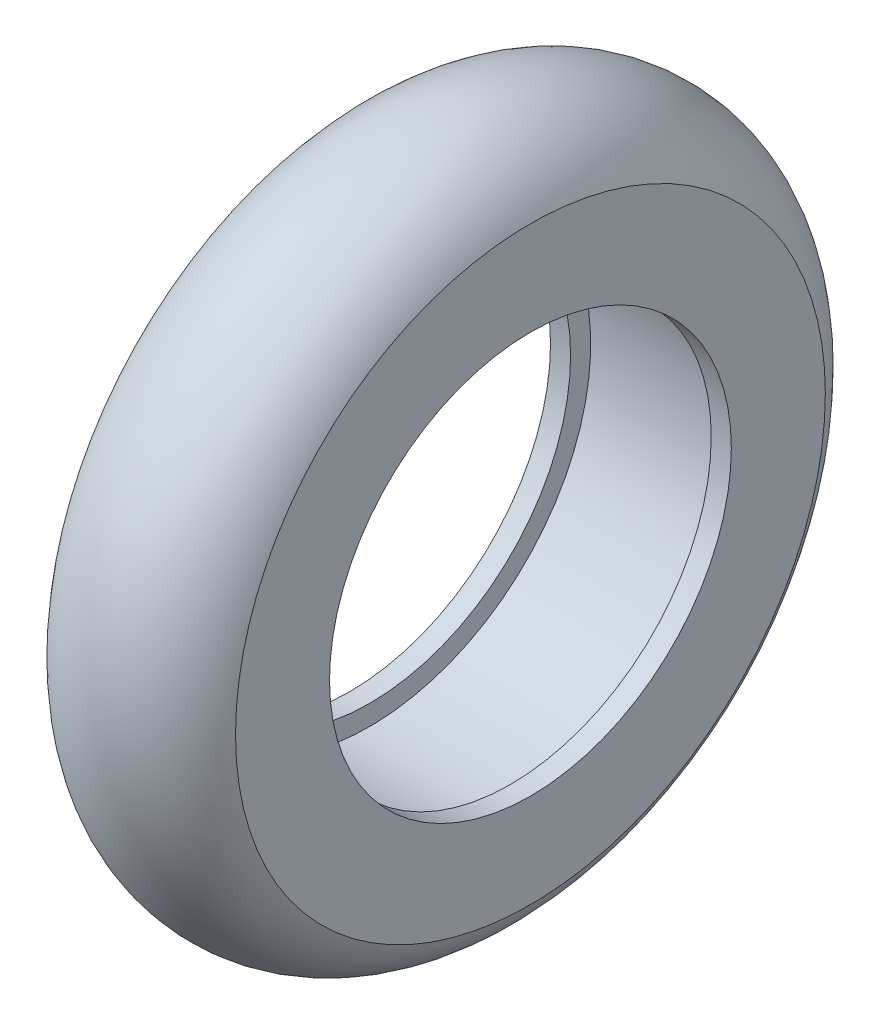
ISO-10303-21;
HEADER;
FILE_DESCRIPTION(('STEP AP214'),'2;1');
FILE_NAME('part.step','',(''),(''),'','','');
FILE_SCHEMA(('AUTOMOTIVE_DESIGN { 1 0 10303 214 1 1 1 1 }'));
ENDSEC;
DATA;
#1=APPLICATION_CONTEXT('core data for automotive mechanical design processes');
#2=APPLICATION_PROTOCOL_DEFINITION('international standard','automotive_design',2000,#1);
#3=PRODUCT_CONTEXT('',#1,'mechanical');
#4=PRODUCT('Part','Part','',(#3));
#5=PRODUCT_RELATED_PRODUCT_CATEGORY('part','',(#4));
#6=PRODUCT_DEFINITION_FORMATION('','',#4);
#7=PRODUCT_DEFINITION_CONTEXT('part definition',#1,'design');
#8=PRODUCT_DEFINITION('design','',#6,#7);
#9=PRODUCT_DEFINITION_SHAPE('','',#8);
#10=(LENGTH_UNIT() NAMED_UNIT(*) SI_UNIT(.MILLI.,.METRE.));
#11=(NAMED_UNIT(*) PLANE_ANGLE_UNIT() SI_UNIT($,.RADIAN.));
#12=(NAMED_UNIT(*) SI_UNIT($,.STERADIAN.) SOLID_ANGLE_UNIT());
#13=UNCERTAINTY_MEASURE_WITH_UNIT(LENGTH_MEASURE(1.E-05),#10,'distance_accuracy_value','');
#14=(GEOMETRIC_REPRESENTATION_CONTEXT(3) GLOBAL_UNCERTAINTY_ASSIGNED_CONTEXT((#13)) GLOBAL_UNIT_ASSIGNED_CONTEXT((#10,
#11,#12)) REPRESENTATION_CONTEXT('',''));
#15=CARTESIAN_POINT('',(0.,0.,0.));
#16=DIRECTION('',(0.,0.,1.));
#17=DIRECTION('',(1.,0.,0.));
#18=AXIS2_PLACEMENT_3D('',#15,#16,#17);
#19=CARTESIAN_POINT('',(-8.,11.,0.));
#20=DIRECTION('',(-1.,0.,0.));
#21=DIRECTION('',(0.,0.,1.));
#22=AXIS2_PLACEMENT_3D('',#19,#20,#21);
#23=PLANE('',#22);
#24=CARTESIAN_POINT('',(-8.,0.,0.));
#25=DIRECTION('',(-1.,0.,0.));
#26=DIRECTION('',(0.,0.,1.));
#27=AXIS2_PLACEMENT_3D('',#24,#25,#26);
#28=CIRCLE('',#27,11.);
#29=CARTESIAN_POINT('',(-8.,0.,11.));
#30=VERTEX_POINT('',#29);
#31=EDGE_CURVE('E10',#30,#30,#28,.T.);
#32=ORIENTED_EDGE('',*,*,#31,.F.);
#33=EDGE_LOOP('',(#32));
#34=FACE_BOUND('',#33,.T.);
#35=CARTESIAN_POINT('',(-8.,0.,0.));
#36=DIRECTION('',(-1.,0.,0.));
#37=DIRECTION('',(0.,0.,1.));
#38=AXIS2_PLACEMENT_3D('',#35,#36,#37);
#39=CIRCLE('',#38,10.);
#40=CARTESIAN_POINT('',(-8.,0.,10.));
#41=VERTEX_POINT('',#40);
#42=EDGE_CURVE('E65',#41,#41,#39,.T.);
#43=ORIENTED_EDGE('',*,*,#42,.T.);
#44=EDGE_LOOP('',(#43));
#45=FACE_BOUND('',#44,.T.);
#46=ADVANCED_FACE('F37',(#34,#45),#23,.F.);
#47=CARTESIAN_POINT('',(-9.,0.,0.));
#48=DIRECTION('',(-1.,0.,0.));
#49=DIRECTION('',(0.,0.,1.));
#50=AXIS2_PLACEMENT_3D('',#47,#48,#49);
#51=CYLINDRICAL_SURFACE('',#50,11.);
#52=CARTESIAN_POINT('',(-0.999999999999999,0.,0.));
#53=DIRECTION('',(-1.,0.,0.));
#54=DIRECTION('',(0.,0.,1.));
#55=AXIS2_PLACEMENT_3D('',#52,#53,#54);
#56=CIRCLE('',#55,11.);
#57=CARTESIAN_POINT('',(-0.999999999999999,0.,11.));
#58=VERTEX_POINT('',#57);
#59=EDGE_CURVE('E43',#58,#58,#56,.T.);
#60=ORIENTED_EDGE('',*,*,#59,.F.);
#61=EDGE_LOOP('',(#60));
#62=FACE_BOUND('',#61,.T.);
#63=ORIENTED_EDGE('',*,*,#31,.T.);
#64=EDGE_LOOP('',(#63));
#65=FACE_BOUND('',#64,.T.);
#66=ADVANCED_FACE('F102',(#62,#65),#51,.F.);
#67=CARTESIAN_POINT('',(-1.,10.,0.));
#68=DIRECTION('',(1.,0.,0.));
#69=DIRECTION('',(0.,0.,-1.));
#70=AXIS2_PLACEMENT_3D('',#67,#68,#69);
#71=PLANE('',#70);
#72=CARTESIAN_POINT('',(-0.999999999999999,0.,0.));
#73=DIRECTION('',(-1.,0.,0.));
#74=DIRECTION('',(0.,0.,1.));
#75=AXIS2_PLACEMENT_3D('',#72,#73,#74);
#76=CIRCLE('',#75,10.);
#77=CARTESIAN_POINT('',(-0.999999999999999,0.,10.));
#78=VERTEX_POINT('',#77);
#79=EDGE_CURVE('E47',#78,#78,#76,.T.);
#80=ORIENTED_EDGE('',*,*,#79,.F.);
#81=EDGE_LOOP('',(#80));
#82=FACE_BOUND('',#81,.T.);
#83=ORIENTED_EDGE('',*,*,#59,.T.);
#84=EDGE_LOOP('',(#83));
#85=FACE_BOUND('',#84,.T.);
#86=ADVANCED_FACE('F97',(#82,#85),#71,.F.);
#87=CARTESIAN_POINT('',(-9.,0.,0.));
#88=DIRECTION('',(-1.,0.,0.));
#89=DIRECTION('',(0.,0.,1.));
#90=AXIS2_PLACEMENT_3D('',#87,#88,#89);
#91=CYLINDRICAL_SURFACE('',#90,10.);
#92=CARTESIAN_POINT('',(0.,0.,0.));
#93=DIRECTION('',(-1.,0.,0.));
#94=DIRECTION('',(0.,0.,1.));
#95=AXIS2_PLACEMENT_3D('',#92,#93,#94);
#96=CIRCLE('',#95,10.);
#97=CARTESIAN_POINT('',(0.,0.,10.));
#98=VERTEX_POINT('',#97);
#99=EDGE_CURVE('E51',#98,#98,#96,.T.);
#100=ORIENTED_EDGE('',*,*,#99,.F.);
#101=EDGE_LOOP('',(#100));
#102=FACE_BOUND('',#101,.T.);
#103=ORIENTED_EDGE('',*,*,#79,.T.);
#104=EDGE_LOOP('',(#103));
#105=FACE_BOUND('',#104,.T.);
#106=ADVANCED_FACE('F91',(#102,#105),#91,.F.);
#107=CARTESIAN_POINT('',(0.,14.6794494717703,0.));
#108=DIRECTION('',(-1.,0.,0.));
#109=DIRECTION('',(0.,0.,1.));
#110=AXIS2_PLACEMENT_3D('',#107,#108,#109);
#111=PLANE('',#110);
#112=CARTESIAN_POINT('',(0.,0.,0.));
#113=DIRECTION('',(-1.,0.,0.));
#114=DIRECTION('',(0.,0.,1.));
#115=AXIS2_PLACEMENT_3D('',#112,#113,#114);
#116=CIRCLE('',#115,14.6794494717703);
#117=CARTESIAN_POINT('',(0.,0.,14.6794494717703));
#118=VERTEX_POINT('',#117);
#119=EDGE_CURVE('E56',#118,#118,#116,.T.);
#120=ORIENTED_EDGE('',*,*,#119,.F.);
#121=EDGE_LOOP('',(#120));
#122=FACE_BOUND('',#121,.T.);
#123=ORIENTED_EDGE('',*,*,#99,.T.);
#124=EDGE_LOOP('',(#123));
#125=FACE_BOUND('',#124,.T.);
#126=ADVANCED_FACE('F85',(#122,#125),#111,.F.);
#127=CARTESIAN_POINT('',(-4.5,0.,0.));
#128=DIRECTION('',(-1.,0.,0.));
#129=DIRECTION('',(0.,0.,1.));
#130=AXIS2_PLACEMENT_3D('',#127,#128,#129);
#131=TOROIDAL_SURFACE('',#130,12.5,5.);
#132=CARTESIAN_POINT('',(-9.,0.,0.));
#133=DIRECTION('',(-1.,0.,0.));
#134=DIRECTION('',(0.,0.,1.));
#135=AXIS2_PLACEMENT_3D('',#132,#133,#134);
#136=CIRCLE('',#135,14.6794494717703);
#137=CARTESIAN_POINT('',(-9.,0.,14.6794494717703));
#138=VERTEX_POINT('',#137);
#139=EDGE_CURVE('E59',#138,#138,#136,.T.);
#140=ORIENTED_EDGE('',*,*,#139,.F.);
#141=EDGE_LOOP('',(#140));
#142=FACE_BOUND('',#141,.T.);
#143=ORIENTED_EDGE('',*,*,#119,.T.);
#144=EDGE_LOOP('',(#143));
#145=FACE_BOUND('',#144,.T.);
#146=ADVANCED_FACE('F79',(#142,#145),#131,.T.);
#147=CARTESIAN_POINT('',(-9.,10.,0.));
#148=DIRECTION('',(1.,0.,0.));
#149=DIRECTION('',(0.,0.,-1.));
#150=AXIS2_PLACEMENT_3D('',#147,#148,#149);
#151=PLANE('',#150);
#152=CARTESIAN_POINT('',(-9.,0.,0.));
#153=DIRECTION('',(-1.,0.,0.));
#154=DIRECTION('',(0.,0.,1.));
#155=AXIS2_PLACEMENT_3D('',#152,#153,#154);
#156=CIRCLE('',#155,10.);
#157=CARTESIAN_POINT('',(-9.,0.,10.));
#158=VERTEX_POINT('',#157);
#159=EDGE_CURVE('E62',#158,#158,#156,.T.);
#160=ORIENTED_EDGE('',*,*,#159,.F.);
#161=EDGE_LOOP('',(#160));
#162=FACE_BOUND('',#161,.T.);
#163=ORIENTED_EDGE('',*,*,#139,.T.);
#164=EDGE_LOOP('',(#163));
#165=FACE_BOUND('',#164,.T.);
#166=ADVANCED_FACE('F73',(#162,#165),#151,.F.);
#167=CARTESIAN_POINT('',(-9.,0.,0.));
#168=DIRECTION('',(-1.,0.,0.));
#169=DIRECTION('',(0.,0.,1.));
#170=AXIS2_PLACEMENT_3D('',#167,#168,#169);
#171=CYLINDRICAL_SURFACE('',#170,10.);
#172=ORIENTED_EDGE('',*,*,#42,.F.);
#173=EDGE_LOOP('',(#172));
#174=FACE_BOUND('',#173,.T.);
#175=ORIENTED_EDGE('',*,*,#159,.T.);
#176=EDGE_LOOP('',(#175));
#177=FACE_BOUND('',#176,.T.);
#178=ADVANCED_FACE('F70',(#174,#177),#171,.F.);
#179=CLOSED_SHELL('',(#46,#66,#86,#106,#126,#146,#166,#178));
#180=MANIFOLD_SOLID_BREP('B2',#179);
#181=ADVANCED_BREP_SHAPE_REPRESENTATION('',(#18,#180),#14);
#182=SHAPE_DEFINITION_REPRESENTATION(#9,#181);
ENDSEC;
END-ISO-10303-21;
